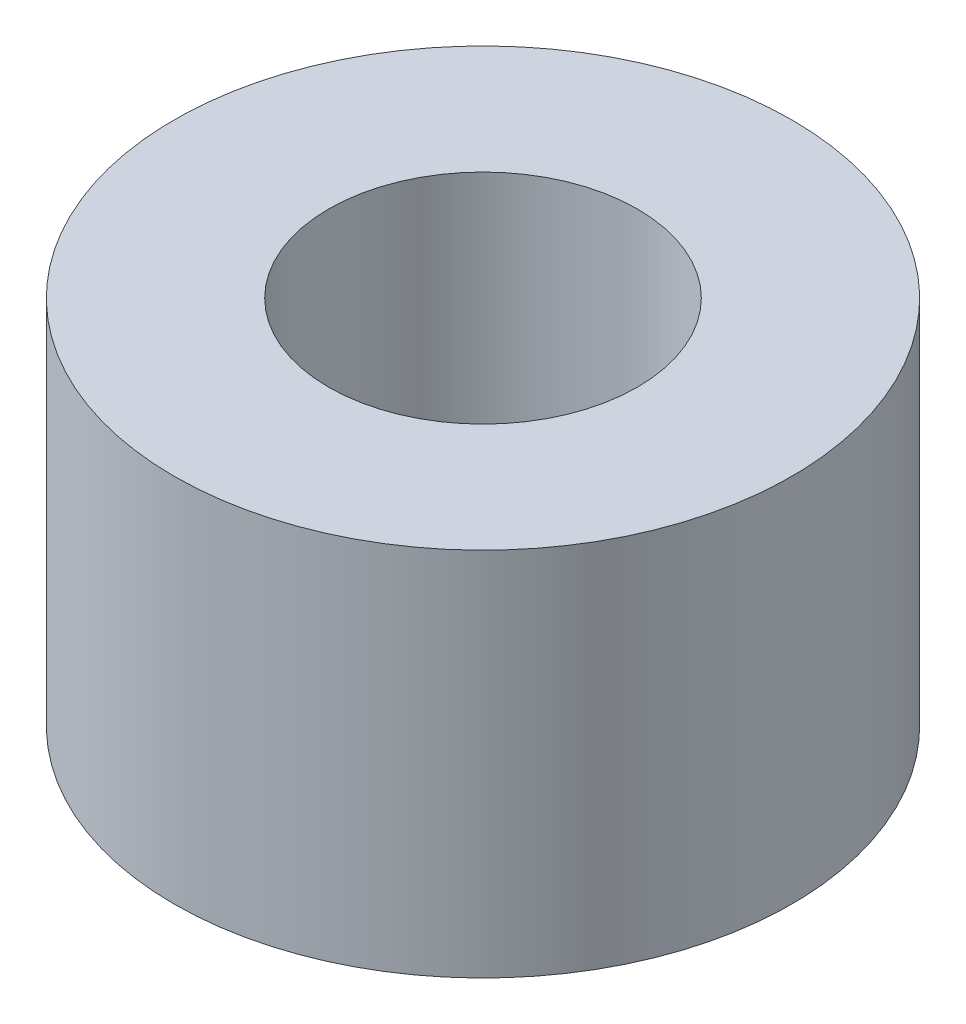
ISO-10303-21;
HEADER;
FILE_DESCRIPTION(('STEP AP214'),'2;1');
FILE_NAME('part.step','',(''),(''),'','','');
FILE_SCHEMA(('AUTOMOTIVE_DESIGN { 1 0 10303 214 1 1 1 1 }'));
ENDSEC;
DATA;
#1=APPLICATION_CONTEXT('core data for automotive mechanical design processes');
#2=APPLICATION_PROTOCOL_DEFINITION('international standard','automotive_design',2000,#1);
#3=PRODUCT_CONTEXT('',#1,'mechanical');
#4=PRODUCT('Part','Part','',(#3));
#5=PRODUCT_RELATED_PRODUCT_CATEGORY('part','',(#4));
#6=PRODUCT_DEFINITION_FORMATION('','',#4);
#7=PRODUCT_DEFINITION_CONTEXT('part definition',#1,'design');
#8=PRODUCT_DEFINITION('design','',#6,#7);
#9=PRODUCT_DEFINITION_SHAPE('','',#8);
#10=(LENGTH_UNIT() NAMED_UNIT(*) SI_UNIT(.MILLI.,.METRE.));
#11=(NAMED_UNIT(*) PLANE_ANGLE_UNIT() SI_UNIT($,.RADIAN.));
#12=(NAMED_UNIT(*) SI_UNIT($,.STERADIAN.) SOLID_ANGLE_UNIT());
#13=UNCERTAINTY_MEASURE_WITH_UNIT(LENGTH_MEASURE(1.E-05),#10,'distance_accuracy_value','');
#14=(GEOMETRIC_REPRESENTATION_CONTEXT(3) GLOBAL_UNCERTAINTY_ASSIGNED_CONTEXT((#13)) GLOBAL_UNIT_ASSIGNED_CONTEXT((#10,
#11,#12)) REPRESENTATION_CONTEXT('',''));
#15=CARTESIAN_POINT('',(0.,0.,0.));
#16=DIRECTION('',(0.,0.,1.));
#17=DIRECTION('',(1.,0.,0.));
#18=AXIS2_PLACEMENT_3D('',#15,#16,#17);
#19=CARTESIAN_POINT('',(0.,3.,0.));
#20=DIRECTION('',(0.,1.,0.));
#21=DIRECTION('',(0.,0.,1.));
#22=AXIS2_PLACEMENT_3D('',#19,#20,#21);
#23=PLANE('',#22);
#24=CARTESIAN_POINT('',(0.,3.,0.));
#25=DIRECTION('',(0.,1.,0.));
#26=DIRECTION('',(0.,0.,1.));
#27=AXIS2_PLACEMENT_3D('',#24,#25,#26);
#28=CIRCLE('',#27,2.5);
#29=CARTESIAN_POINT('',(0.,3.,2.5));
#30=VERTEX_POINT('',#29);
#31=EDGE_CURVE('E10',#30,#30,#28,.T.);
#32=ORIENTED_EDGE('',*,*,#31,.T.);
#33=EDGE_LOOP('',(#32));
#34=FACE_BOUND('',#33,.T.);
#35=CARTESIAN_POINT('',(0.,3.,0.));
#36=DIRECTION('',(0.,1.,0.));
#37=DIRECTION('',(0.,0.,1.));
#38=AXIS2_PLACEMENT_3D('',#35,#36,#37);
#39=CIRCLE('',#38,1.25);
#40=CARTESIAN_POINT('',(0.,3.,1.25));
#41=VERTEX_POINT('',#40);
#42=EDGE_CURVE('E54',#41,#41,#39,.T.);
#43=ORIENTED_EDGE('',*,*,#42,.F.);
#44=EDGE_LOOP('',(#43));
#45=FACE_BOUND('',#44,.T.);
#46=ADVANCED_FACE('F41',(#34,#45),#23,.T.);
#47=CARTESIAN_POINT('',(0.,0.,0.));
#48=DIRECTION('',(0.,1.,0.));
#49=DIRECTION('',(0.,0.,1.));
#50=AXIS2_PLACEMENT_3D('',#47,#48,#49);
#51=PLANE('',#50);
#52=CARTESIAN_POINT('',(0.,0.,0.));
#53=DIRECTION('',(0.,1.,0.));
#54=DIRECTION('',(0.,0.,1.));
#55=AXIS2_PLACEMENT_3D('',#52,#53,#54);
#56=CIRCLE('',#55,2.5);
#57=CARTESIAN_POINT('',(0.,0.,2.5));
#58=VERTEX_POINT('',#57);
#59=EDGE_CURVE('E45',#58,#58,#56,.T.);
#60=ORIENTED_EDGE('',*,*,#59,.F.);
#61=EDGE_LOOP('',(#60));
#62=FACE_BOUND('',#61,.T.);
#63=CARTESIAN_POINT('',(0.,0.,0.));
#64=DIRECTION('',(0.,1.,0.));
#65=DIRECTION('',(0.,0.,1.));
#66=AXIS2_PLACEMENT_3D('',#63,#64,#65);
#67=CIRCLE('',#66,1.25);
#68=CARTESIAN_POINT('',(0.,0.,1.25));
#69=VERTEX_POINT('',#68);
#70=EDGE_CURVE('E56',#69,#69,#67,.T.);
#71=ORIENTED_EDGE('',*,*,#70,.T.);
#72=EDGE_LOOP('',(#71));
#73=FACE_BOUND('',#72,.T.);
#74=ADVANCED_FACE('F68',(#62,#73),#51,.F.);
#75=CARTESIAN_POINT('',(0.,3.,0.));
#76=DIRECTION('',(0.,-1.,0.));
#77=DIRECTION('',(0.,0.,-1.));
#78=AXIS2_PLACEMENT_3D('',#75,#76,#77);
#79=CYLINDRICAL_SURFACE('',#78,2.5);
#80=ORIENTED_EDGE('',*,*,#31,.F.);
#81=EDGE_LOOP('',(#80));
#82=FACE_BOUND('',#81,.T.);
#83=ORIENTED_EDGE('',*,*,#59,.T.);
#84=EDGE_LOOP('',(#83));
#85=FACE_BOUND('',#84,.T.);
#86=ADVANCED_FACE('F43',(#82,#85),#79,.T.);
#87=CARTESIAN_POINT('',(0.,3.,0.));
#88=DIRECTION('',(0.,-1.,0.));
#89=DIRECTION('',(0.,0.,-1.));
#90=AXIS2_PLACEMENT_3D('',#87,#88,#89);
#91=CYLINDRICAL_SURFACE('',#90,1.25);
#92=ORIENTED_EDGE('',*,*,#42,.T.);
#93=EDGE_LOOP('',(#92));
#94=FACE_BOUND('',#93,.T.);
#95=ORIENTED_EDGE('',*,*,#70,.F.);
#96=EDGE_LOOP('',(#95));
#97=FACE_BOUND('',#96,.T.);
#98=ADVANCED_FACE('F64',(#94,#97),#91,.F.);
#99=CLOSED_SHELL('',(#46,#74,#86,#98));
#100=MANIFOLD_SOLID_BREP('B2',#99);
#101=ADVANCED_BREP_SHAPE_REPRESENTATION('',(#18,#100),#14);
#102=SHAPE_DEFINITION_REPRESENTATION(#9,#101);
ENDSEC;
END-ISO-10303-21;
